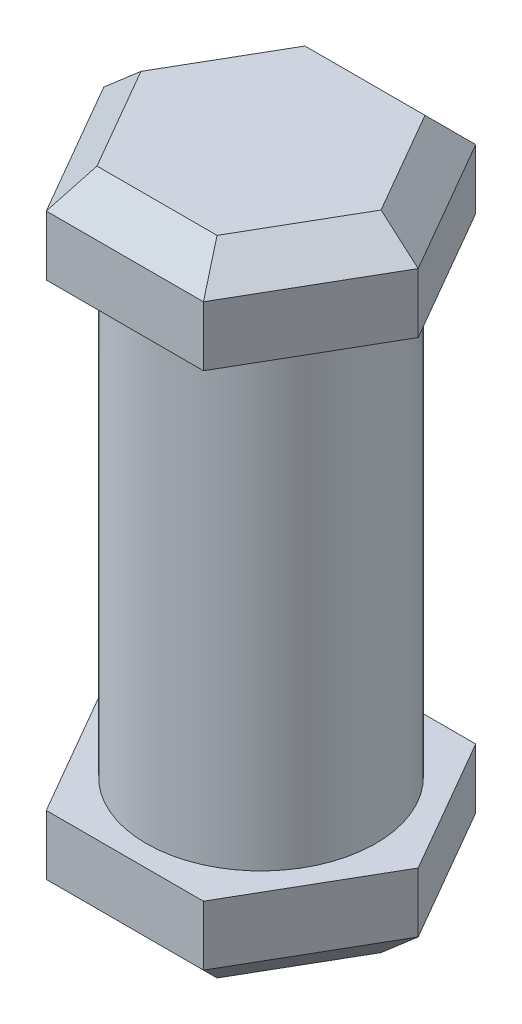
ISO-10303-21;
HEADER;
FILE_DESCRIPTION(('STEP AP214'),'2;1');
FILE_NAME('part.step','',(''),(''),'','','');
FILE_SCHEMA(('AUTOMOTIVE_DESIGN { 1 0 10303 214 1 1 1 1 }'));
ENDSEC;
DATA;
#1=APPLICATION_CONTEXT('core data for automotive mechanical design processes');
#2=APPLICATION_PROTOCOL_DEFINITION('international standard','automotive_design',2000,#1);
#3=PRODUCT_CONTEXT('',#1,'mechanical');
#4=PRODUCT('Part','Part','',(#3));
#5=PRODUCT_RELATED_PRODUCT_CATEGORY('part','',(#4));
#6=PRODUCT_DEFINITION_FORMATION('','',#4);
#7=PRODUCT_DEFINITION_CONTEXT('part definition',#1,'design');
#8=PRODUCT_DEFINITION('design','',#6,#7);
#9=PRODUCT_DEFINITION_SHAPE('','',#8);
#10=(LENGTH_UNIT() NAMED_UNIT(*) SI_UNIT(.MILLI.,.METRE.));
#11=(NAMED_UNIT(*) PLANE_ANGLE_UNIT() SI_UNIT($,.RADIAN.));
#12=(NAMED_UNIT(*) SI_UNIT($,.STERADIAN.) SOLID_ANGLE_UNIT());
#13=UNCERTAINTY_MEASURE_WITH_UNIT(LENGTH_MEASURE(1.E-05),#10,'distance_accuracy_value','');
#14=(GEOMETRIC_REPRESENTATION_CONTEXT(3) GLOBAL_UNCERTAINTY_ASSIGNED_CONTEXT((#13)) GLOBAL_UNIT_ASSIGNED_CONTEXT((#10,
#11,#12)) REPRESENTATION_CONTEXT('',''));
#15=CARTESIAN_POINT('',(0.,0.,0.));
#16=DIRECTION('',(0.,0.,1.));
#17=DIRECTION('',(1.,0.,0.));
#18=AXIS2_PLACEMENT_3D('',#15,#16,#17);
#19=CARTESIAN_POINT('',(0.,10.,0.));
#20=DIRECTION('',(0.,-1.,0.));
#21=DIRECTION('',(0.,0.,-1.));
#22=AXIS2_PLACEMENT_3D('',#19,#20,#21);
#23=CYLINDRICAL_SURFACE('',#22,2.5);
#24=CARTESIAN_POINT('',(0.,10.,0.));
#25=DIRECTION('',(0.,1.,0.));
#26=DIRECTION('',(0.,0.,1.));
#27=AXIS2_PLACEMENT_3D('',#24,#25,#26);
#28=CIRCLE('',#27,2.5);
#29=CARTESIAN_POINT('',(0.,10.,2.5));
#30=VERTEX_POINT('',#29);
#31=EDGE_CURVE('E269',#30,#30,#28,.T.);
#32=ORIENTED_EDGE('',*,*,#31,.F.);
#33=EDGE_LOOP('',(#32));
#34=FACE_BOUND('',#33,.T.);
#35=CARTESIAN_POINT('',(0.,0.,0.));
#36=DIRECTION('',(0.,1.,0.));
#37=DIRECTION('',(0.,0.,1.));
#38=AXIS2_PLACEMENT_3D('',#35,#36,#37);
#39=CIRCLE('',#38,2.5);
#40=CARTESIAN_POINT('',(0.,0.,2.5));
#41=VERTEX_POINT('',#40);
#42=EDGE_CURVE('E268',#41,#41,#39,.T.);
#43=ORIENTED_EDGE('',*,*,#42,.T.);
#44=EDGE_LOOP('',(#43));
#45=FACE_BOUND('',#44,.T.);
#46=ADVANCED_FACE('F41',(#34,#45),#23,.T.);
#47=CARTESIAN_POINT('',(1.71094385446384,-2.,-2.96344168482902));
#48=DIRECTION('',(-0.866025403784442,0.,0.499999999999995));
#49=DIRECTION('',(0.499999999999995,0.,0.866025403784442));
#50=AXIS2_PLACEMENT_3D('',#47,#48,#49);
#51=PLANE('',#50);
#52=DIRECTION('',(0.,1.,0.));
#53=VECTOR('',#52,1.);
#54=CARTESIAN_POINT('',(3.42188770892761,-2.,0.));
#55=LINE('',#54,#53);
#56=CARTESIAN_POINT('',(3.42188770892761,-1.3,0.));
#57=VERTEX_POINT('',#56);
#58=CARTESIAN_POINT('',(3.42188770892761,0.,0.));
#59=VERTEX_POINT('',#58);
#60=EDGE_CURVE('E265',#57,#59,#55,.T.);
#61=ORIENTED_EDGE('',*,*,#60,.F.);
#62=DIRECTION('',(-0.499999999999995,0.,-0.866025403784442));
#63=VECTOR('',#62,1.);
#64=CARTESIAN_POINT('',(1.71094385446384,-1.3,-2.96344168482902));
#65=LINE('',#64,#63);
#66=CARTESIAN_POINT('',(1.71094385446384,-1.3,-2.96344168482902));
#67=VERTEX_POINT('',#66);
#68=EDGE_CURVE('E311',#57,#67,#65,.T.);
#69=ORIENTED_EDGE('',*,*,#68,.T.);
#70=DIRECTION('',(0.,1.,0.));
#71=VECTOR('',#70,1.);
#72=CARTESIAN_POINT('',(1.71094385446384,-2.,-2.96344168482902));
#73=LINE('',#72,#71);
#74=CARTESIAN_POINT('',(1.71094385446384,0.,-2.96344168482902));
#75=VERTEX_POINT('',#74);
#76=EDGE_CURVE('E250',#67,#75,#73,.T.);
#77=ORIENTED_EDGE('',*,*,#76,.T.);
#78=DIRECTION('',(0.499999999999995,0.,0.866025403784441));
#79=VECTOR('',#78,1.);
#80=CARTESIAN_POINT('',(1.71094385446384,0.,-2.96344168482902));
#81=LINE('',#80,#79);
#82=EDGE_CURVE('E176',#75,#59,#81,.T.);
#83=ORIENTED_EDGE('',*,*,#82,.T.);
#84=EDGE_LOOP('',(#61,#69,#77,#83));
#85=FACE_BOUND('',#84,.T.);
#86=ADVANCED_FACE('F427',(#85),#51,.F.);
#87=CARTESIAN_POINT('',(3.42188770892761,-2.,0.));
#88=DIRECTION('',(-0.866025403784438,0.,-0.500000000000001));
#89=DIRECTION('',(-0.500000000000001,0.,0.866025403784438));
#90=AXIS2_PLACEMENT_3D('',#87,#88,#89);
#91=PLANE('',#90);
#92=DIRECTION('',(0.,1.,0.));
#93=VECTOR('',#92,1.);
#94=CARTESIAN_POINT('',(1.7109438544638,-2.,2.96344168482905));
#95=LINE('',#94,#93);
#96=CARTESIAN_POINT('',(1.7109438544638,-1.3,2.96344168482905));
#97=VERTEX_POINT('',#96);
#98=CARTESIAN_POINT('',(1.7109438544638,0.,2.96344168482905));
#99=VERTEX_POINT('',#98);
#100=EDGE_CURVE('E262',#97,#99,#95,.T.);
#101=ORIENTED_EDGE('',*,*,#100,.F.);
#102=DIRECTION('',(0.500000000000001,0.,-0.866025403784438));
#103=VECTOR('',#102,1.);
#104=CARTESIAN_POINT('',(3.42188770892761,-1.3,0.));
#105=LINE('',#104,#103);
#106=EDGE_CURVE('E308',#97,#57,#105,.T.);
#107=ORIENTED_EDGE('',*,*,#106,.T.);
#108=ORIENTED_EDGE('',*,*,#60,.T.);
#109=DIRECTION('',(-0.500000000000001,0.,0.866025403784438));
#110=VECTOR('',#109,1.);
#111=CARTESIAN_POINT('',(3.42188770892761,0.,0.));
#112=LINE('',#111,#110);
#113=EDGE_CURVE('E230',#59,#99,#112,.T.);
#114=ORIENTED_EDGE('',*,*,#113,.T.);
#115=EDGE_LOOP('',(#101,#107,#108,#114));
#116=FACE_BOUND('',#115,.T.);
#117=ADVANCED_FACE('F433',(#116),#91,.F.);
#118=CARTESIAN_POINT('',(1.7109438544638,-2.,2.96344168482905));
#119=DIRECTION('',(0.,0.,-1.));
#120=DIRECTION('',(-1.,0.,0.));
#121=AXIS2_PLACEMENT_3D('',#118,#119,#120);
#122=PLANE('',#121);
#123=DIRECTION('',(0.,1.,0.));
#124=VECTOR('',#123,1.);
#125=CARTESIAN_POINT('',(-1.71094385446382,-2.,2.96344168482903));
#126=LINE('',#125,#124);
#127=CARTESIAN_POINT('',(-1.71094385446382,-1.3,2.96344168482903));
#128=VERTEX_POINT('',#127);
#129=CARTESIAN_POINT('',(-1.71094385446382,0.,2.96344168482903));
#130=VERTEX_POINT('',#129);
#131=EDGE_CURVE('E259',#128,#130,#126,.T.);
#132=ORIENTED_EDGE('',*,*,#131,.F.);
#133=DIRECTION('',(1.,0.,0.));
#134=VECTOR('',#133,1.);
#135=CARTESIAN_POINT('',(1.7109438544638,-1.3,2.96344168482905));
#136=LINE('',#135,#134);
#137=EDGE_CURVE('E305',#128,#97,#136,.T.);
#138=ORIENTED_EDGE('',*,*,#137,.T.);
#139=ORIENTED_EDGE('',*,*,#100,.T.);
#140=DIRECTION('',(-1.,0.,0.));
#141=VECTOR('',#140,1.);
#142=CARTESIAN_POINT('',(1.7109438544638,0.,2.96344168482905));
#143=LINE('',#142,#141);
#144=EDGE_CURVE('E234',#99,#130,#143,.T.);
#145=ORIENTED_EDGE('',*,*,#144,.T.);
#146=EDGE_LOOP('',(#132,#138,#139,#145));
#147=FACE_BOUND('',#146,.T.);
#148=ADVANCED_FACE('F628',(#147),#122,.F.);
#149=CARTESIAN_POINT('',(-1.71094385446382,-2.,2.96344168482903));
#150=DIRECTION('',(0.866025403784442,0.,-0.499999999999995));
#151=DIRECTION('',(-0.499999999999995,0.,-0.866025403784442));
#152=AXIS2_PLACEMENT_3D('',#149,#150,#151);
#153=PLANE('',#152);
#154=DIRECTION('',(0.,1.,0.));
#155=VECTOR('',#154,1.);
#156=CARTESIAN_POINT('',(-3.42188770892761,-2.,0.));
#157=LINE('',#156,#155);
#158=CARTESIAN_POINT('',(-3.42188770892761,-1.3,0.));
#159=VERTEX_POINT('',#158);
#160=CARTESIAN_POINT('',(-3.42188770892761,0.,0.));
#161=VERTEX_POINT('',#160);
#162=EDGE_CURVE('E256',#159,#161,#157,.T.);
#163=ORIENTED_EDGE('',*,*,#162,.F.);
#164=DIRECTION('',(0.499999999999995,0.,0.866025403784442));
#165=VECTOR('',#164,1.);
#166=CARTESIAN_POINT('',(-1.71094385446382,-1.3,2.96344168482903));
#167=LINE('',#166,#165);
#168=EDGE_CURVE('E302',#159,#128,#167,.T.);
#169=ORIENTED_EDGE('',*,*,#168,.T.);
#170=ORIENTED_EDGE('',*,*,#131,.T.);
#171=DIRECTION('',(-0.499999999999995,0.,-0.866025403784442));
#172=VECTOR('',#171,1.);
#173=CARTESIAN_POINT('',(-1.71094385446382,0.,2.96344168482903));
#174=LINE('',#173,#172);
#175=EDGE_CURVE('E238',#130,#161,#174,.T.);
#176=ORIENTED_EDGE('',*,*,#175,.T.);
#177=EDGE_LOOP('',(#163,#169,#170,#176));
#178=FACE_BOUND('',#177,.T.);
#179=ADVANCED_FACE('F618',(#178),#153,.F.);
#180=CARTESIAN_POINT('',(-3.42188770892761,-2.,0.));
#181=DIRECTION('',(0.866025403784435,0.,0.500000000000007));
#182=DIRECTION('',(0.500000000000007,0.,-0.866025403784434));
#183=AXIS2_PLACEMENT_3D('',#180,#181,#182);
#184=PLANE('',#183);
#185=DIRECTION('',(0.,1.,0.));
#186=VECTOR('',#185,1.);
#187=CARTESIAN_POINT('',(-1.71094385446378,-2.,-2.96344168482906));
#188=LINE('',#187,#186);
#189=CARTESIAN_POINT('',(-1.71094385446378,-1.3,-2.96344168482906));
#190=VERTEX_POINT('',#189);
#191=CARTESIAN_POINT('',(-1.71094385446378,0.,-2.96344168482906));
#192=VERTEX_POINT('',#191);
#193=EDGE_CURVE('E253',#190,#192,#188,.T.);
#194=ORIENTED_EDGE('',*,*,#193,.F.);
#195=DIRECTION('',(-0.500000000000007,0.,0.866025403784434));
#196=VECTOR('',#195,1.);
#197=CARTESIAN_POINT('',(-3.42188770892761,-1.3,0.));
#198=LINE('',#197,#196);
#199=EDGE_CURVE('E299',#190,#159,#198,.T.);
#200=ORIENTED_EDGE('',*,*,#199,.T.);
#201=ORIENTED_EDGE('',*,*,#162,.T.);
#202=DIRECTION('',(0.500000000000007,0.,-0.866025403784435));
#203=VECTOR('',#202,1.);
#204=CARTESIAN_POINT('',(-3.42188770892761,0.,0.));
#205=LINE('',#204,#203);
#206=EDGE_CURVE('E242',#161,#192,#205,.T.);
#207=ORIENTED_EDGE('',*,*,#206,.T.);
#208=EDGE_LOOP('',(#194,#200,#201,#207));
#209=FACE_BOUND('',#208,.T.);
#210=ADVANCED_FACE('F608',(#209),#184,.F.);
#211=CARTESIAN_POINT('',(-1.71094385446378,-2.,-2.96344168482906));
#212=DIRECTION('',(0.,0.,1.));
#213=DIRECTION('',(1.,0.,0.));
#214=AXIS2_PLACEMENT_3D('',#211,#212,#213);
#215=PLANE('',#214);
#216=ORIENTED_EDGE('',*,*,#76,.F.);
#217=DIRECTION('',(-1.,0.,0.));
#218=VECTOR('',#217,1.);
#219=CARTESIAN_POINT('',(-1.71094385446378,-1.3,-2.96344168482906));
#220=LINE('',#219,#218);
#221=EDGE_CURVE('E295',#67,#190,#220,.T.);
#222=ORIENTED_EDGE('',*,*,#221,.T.);
#223=ORIENTED_EDGE('',*,*,#193,.T.);
#224=DIRECTION('',(1.,0.,0.));
#225=VECTOR('',#224,1.);
#226=CARTESIAN_POINT('',(-1.71094385446378,0.,-2.96344168482906));
#227=LINE('',#226,#225);
#228=EDGE_CURVE('E246',#192,#75,#227,.T.);
#229=ORIENTED_EDGE('',*,*,#228,.T.);
#230=EDGE_LOOP('',(#216,#222,#223,#229));
#231=FACE_BOUND('',#230,.T.);
#232=ADVANCED_FACE('F598',(#231),#215,.F.);
#233=CARTESIAN_POINT('',(0.,-2.,0.));
#234=DIRECTION('',(0.,-1.,0.));
#235=DIRECTION('',(0.,0.,-1.));
#236=AXIS2_PLACEMENT_3D('',#233,#234,#235);
#237=PLANE('',#236);
#238=DIRECTION('',(0.500000000000007,0.,-0.866025403784435));
#239=VECTOR('',#238,1.);
#240=CARTESIAN_POINT('',(-1.10472607181468,-2.,-2.61344168482905));
#241=LINE('',#240,#239);
#242=CARTESIAN_POINT('',(-2.61359733206214,-2.,0.));
#243=VERTEX_POINT('',#242);
#244=CARTESIAN_POINT('',(-1.30679866603105,-2.,-2.26344168482906));
#245=VERTEX_POINT('',#244);
#246=EDGE_CURVE('E288',#243,#245,#241,.T.);
#247=ORIENTED_EDGE('',*,*,#246,.T.);
#248=DIRECTION('',(1.,0.,0.));
#249=VECTOR('',#248,1.);
#250=CARTESIAN_POINT('',(1.71094385446383,-2.,-2.26344168482902));
#251=LINE('',#250,#249);
#252=CARTESIAN_POINT('',(1.3067986660311,-2.,-2.26344168482903));
#253=VERTEX_POINT('',#252);
#254=EDGE_CURVE('E291',#245,#253,#251,.T.);
#255=ORIENTED_EDGE('',*,*,#254,.T.);
#256=DIRECTION('',(0.499999999999995,0.,0.866025403784442));
#257=VECTOR('',#256,1.);
#258=CARTESIAN_POINT('',(2.8156699262785,-2.,0.349999999999995));
#259=LINE('',#258,#257);
#260=CARTESIAN_POINT('',(2.61359733206214,-2.,0.));
#261=VERTEX_POINT('',#260);
#262=EDGE_CURVE('E273',#253,#261,#259,.T.);
#263=ORIENTED_EDGE('',*,*,#262,.T.);
#264=DIRECTION('',(-0.500000000000001,0.,0.866025403784438));
#265=VECTOR('',#264,1.);
#266=CARTESIAN_POINT('',(1.10472607181469,-2.,2.61344168482905));
#267=LINE('',#266,#265);
#268=CARTESIAN_POINT('',(1.30679866603106,-2.,2.26344168482905));
#269=VERTEX_POINT('',#268);
#270=EDGE_CURVE('E279',#261,#269,#267,.T.);
#271=ORIENTED_EDGE('',*,*,#270,.T.);
#272=DIRECTION('',(-1.,0.,0.));
#273=VECTOR('',#272,1.);
#274=CARTESIAN_POINT('',(-1.71094385446382,-2.,2.26344168482904));
#275=LINE('',#274,#273);
#276=CARTESIAN_POINT('',(-1.30679866603108,-2.,2.26344168482904));
#277=VERTEX_POINT('',#276);
#278=EDGE_CURVE('E282',#269,#277,#275,.T.);
#279=ORIENTED_EDGE('',*,*,#278,.T.);
#280=DIRECTION('',(-0.499999999999995,0.,-0.866025403784442));
#281=VECTOR('',#280,1.);
#282=CARTESIAN_POINT('',(-2.8156699262785,-2.,-0.350000000000019));
#283=LINE('',#282,#281);
#284=EDGE_CURVE('E285',#277,#243,#283,.T.);
#285=ORIENTED_EDGE('',*,*,#284,.T.);
#286=EDGE_LOOP('',(#247,#255,#263,#271,#279,#285));
#287=FACE_BOUND('',#286,.T.);
#288=ADVANCED_FACE('F593',(#287),#237,.T.);
#289=CARTESIAN_POINT('',(0.,0.,0.));
#290=DIRECTION('',(0.,-1.,0.));
#291=DIRECTION('',(0.,0.,-1.));
#292=AXIS2_PLACEMENT_3D('',#289,#290,#291);
#293=PLANE('',#292);
#294=ORIENTED_EDGE('',*,*,#42,.F.);
#295=EDGE_LOOP('',(#294));
#296=FACE_BOUND('',#295,.T.);
#297=ORIENTED_EDGE('',*,*,#82,.F.);
#298=ORIENTED_EDGE('',*,*,#228,.F.);
#299=ORIENTED_EDGE('',*,*,#206,.F.);
#300=ORIENTED_EDGE('',*,*,#175,.F.);
#301=ORIENTED_EDGE('',*,*,#144,.F.);
#302=ORIENTED_EDGE('',*,*,#113,.F.);
#303=EDGE_LOOP('',(#297,#298,#299,#300,#301,#302));
#304=FACE_BOUND('',#303,.T.);
#305=ADVANCED_FACE('F586',(#296,#304),#293,.F.);
#306=CARTESIAN_POINT('',(1.7109438544638,12.,-2.96344168482905));
#307=DIRECTION('',(0.,0.,1.));
#308=DIRECTION('',(1.,0.,0.));
#309=AXIS2_PLACEMENT_3D('',#306,#307,#308);
#310=PLANE('',#309);
#311=DIRECTION('',(0.,-1.,0.));
#312=VECTOR('',#311,1.);
#313=CARTESIAN_POINT('',(-1.71094385446382,12.,-2.96344168482903));
#314=LINE('',#313,#312);
#315=CARTESIAN_POINT('',(-1.71094385446382,11.3,-2.96344168482903));
#316=VERTEX_POINT('',#315);
#317=CARTESIAN_POINT('',(-1.71094385446382,10.,-2.96344168482903));
#318=VERTEX_POINT('',#317);
#319=EDGE_CURVE('E167',#316,#318,#314,.T.);
#320=ORIENTED_EDGE('',*,*,#319,.F.);
#321=DIRECTION('',(1.,0.,0.));
#322=VECTOR('',#321,1.);
#323=CARTESIAN_POINT('',(1.7109438544638,11.3,-2.96344168482905));
#324=LINE('',#323,#322);
#325=CARTESIAN_POINT('',(1.7109438544638,11.3,-2.96344168482905));
#326=VERTEX_POINT('',#325);
#327=EDGE_CURVE('E11',#316,#326,#324,.T.);
#328=ORIENTED_EDGE('',*,*,#327,.T.);
#329=DIRECTION('',(0.,-1.,0.));
#330=VECTOR('',#329,1.);
#331=CARTESIAN_POINT('',(1.7109438544638,12.,-2.96344168482905));
#332=LINE('',#331,#330);
#333=CARTESIAN_POINT('',(1.7109438544638,10.,-2.96344168482905));
#334=VERTEX_POINT('',#333);
#335=EDGE_CURVE('E191',#326,#334,#332,.T.);
#336=ORIENTED_EDGE('',*,*,#335,.T.);
#337=DIRECTION('',(-1.,0.,0.));
#338=VECTOR('',#337,1.);
#339=CARTESIAN_POINT('',(1.7109438544638,10.,-2.96344168482905));
#340=LINE('',#339,#338);
#341=EDGE_CURVE('E183',#334,#318,#340,.T.);
#342=ORIENTED_EDGE('',*,*,#341,.T.);
#343=EDGE_LOOP('',(#320,#328,#336,#342));
#344=FACE_BOUND('',#343,.T.);
#345=ADVANCED_FACE('F189',(#344),#310,.F.);
#346=CARTESIAN_POINT('',(-1.71094385446382,12.,-2.96344168482903));
#347=DIRECTION('',(0.866025403784442,0.,0.499999999999995));
#348=DIRECTION('',(0.499999999999995,0.,-0.866025403784442));
#349=AXIS2_PLACEMENT_3D('',#346,#347,#348);
#350=PLANE('',#349);
#351=DIRECTION('',(0.,-1.,0.));
#352=VECTOR('',#351,1.);
#353=CARTESIAN_POINT('',(-3.42188770892761,12.,0.));
#354=LINE('',#353,#352);
#355=CARTESIAN_POINT('',(-3.42188770892761,11.3,0.));
#356=VERTEX_POINT('',#355);
#357=CARTESIAN_POINT('',(-3.42188770892761,10.,0.));
#358=VERTEX_POINT('',#357);
#359=EDGE_CURVE('E177',#356,#358,#354,.T.);
#360=ORIENTED_EDGE('',*,*,#359,.F.);
#361=DIRECTION('',(0.499999999999995,0.,-0.866025403784442));
#362=VECTOR('',#361,1.);
#363=CARTESIAN_POINT('',(-1.71094385446382,11.3,-2.96344168482903));
#364=LINE('',#363,#362);
#365=EDGE_CURVE('E52',#356,#316,#364,.T.);
#366=ORIENTED_EDGE('',*,*,#365,.T.);
#367=ORIENTED_EDGE('',*,*,#319,.T.);
#368=DIRECTION('',(-0.499999999999995,0.,0.866025403784442));
#369=VECTOR('',#368,1.);
#370=CARTESIAN_POINT('',(-1.71094385446382,10.,-2.96344168482903));
#371=LINE('',#370,#369);
#372=EDGE_CURVE('E170',#318,#358,#371,.T.);
#373=ORIENTED_EDGE('',*,*,#372,.T.);
#374=EDGE_LOOP('',(#360,#366,#367,#373));
#375=FACE_BOUND('',#374,.T.);
#376=ADVANCED_FACE('F169',(#375),#350,.F.);
#377=CARTESIAN_POINT('',(-3.42188770892761,12.,0.));
#378=DIRECTION('',(0.866025403784435,0.,-0.500000000000007));
#379=DIRECTION('',(-0.500000000000007,0.,-0.866025403784434));
#380=AXIS2_PLACEMENT_3D('',#377,#378,#379);
#381=PLANE('',#380);
#382=DIRECTION('',(0.,-1.,0.));
#383=VECTOR('',#382,1.);
#384=CARTESIAN_POINT('',(-1.71094385446378,12.,2.96344168482906));
#385=LINE('',#384,#383);
#386=CARTESIAN_POINT('',(-1.71094385446378,11.3,2.96344168482906));
#387=VERTEX_POINT('',#386);
#388=CARTESIAN_POINT('',(-1.71094385446378,10.,2.96344168482906));
#389=VERTEX_POINT('',#388);
#390=EDGE_CURVE('E222',#387,#389,#385,.T.);
#391=ORIENTED_EDGE('',*,*,#390,.F.);
#392=DIRECTION('',(-0.500000000000007,0.,-0.866025403784434));
#393=VECTOR('',#392,1.);
#394=CARTESIAN_POINT('',(-3.42188770892761,11.3,0.));
#395=LINE('',#394,#393);
#396=EDGE_CURVE('E67',#387,#356,#395,.T.);
#397=ORIENTED_EDGE('',*,*,#396,.T.);
#398=ORIENTED_EDGE('',*,*,#359,.T.);
#399=DIRECTION('',(0.500000000000007,0.,0.866025403784435));
#400=VECTOR('',#399,1.);
#401=CARTESIAN_POINT('',(-3.42188770892761,10.,0.));
#402=LINE('',#401,#400);
#403=EDGE_CURVE('E186',#358,#389,#402,.T.);
#404=ORIENTED_EDGE('',*,*,#403,.T.);
#405=EDGE_LOOP('',(#391,#397,#398,#404));
#406=FACE_BOUND('',#405,.T.);
#407=ADVANCED_FACE('F417',(#406),#381,.F.);
#408=CARTESIAN_POINT('',(-1.71094385446378,12.,2.96344168482906));
#409=DIRECTION('',(0.,0.,-1.));
#410=DIRECTION('',(-1.,0.,0.));
#411=AXIS2_PLACEMENT_3D('',#408,#409,#410);
#412=PLANE('',#411);
#413=DIRECTION('',(0.,-1.,0.));
#414=VECTOR('',#413,1.);
#415=CARTESIAN_POINT('',(1.71094385446384,12.,2.96344168482902));
#416=LINE('',#415,#414);
#417=CARTESIAN_POINT('',(1.71094385446384,11.3,2.96344168482902));
#418=VERTEX_POINT('',#417);
#419=CARTESIAN_POINT('',(1.71094385446384,10.,2.96344168482902));
#420=VERTEX_POINT('',#419);
#421=EDGE_CURVE('E219',#418,#420,#416,.T.);
#422=ORIENTED_EDGE('',*,*,#421,.F.);
#423=DIRECTION('',(-1.,0.,0.));
#424=VECTOR('',#423,1.);
#425=CARTESIAN_POINT('',(-1.71094385446378,11.3,2.96344168482906));
#426=LINE('',#425,#424);
#427=EDGE_CURVE('E340',#418,#387,#426,.T.);
#428=ORIENTED_EDGE('',*,*,#427,.T.);
#429=ORIENTED_EDGE('',*,*,#390,.T.);
#430=DIRECTION('',(1.,0.,0.));
#431=VECTOR('',#430,1.);
#432=CARTESIAN_POINT('',(-1.71094385446378,10.,2.96344168482906));
#433=LINE('',#432,#431);
#434=EDGE_CURVE('E203',#389,#420,#433,.T.);
#435=ORIENTED_EDGE('',*,*,#434,.T.);
#436=EDGE_LOOP('',(#422,#428,#429,#435));
#437=FACE_BOUND('',#436,.T.);
#438=ADVANCED_FACE('F415',(#437),#412,.F.);
#439=CARTESIAN_POINT('',(1.71094385446384,12.,2.96344168482902));
#440=DIRECTION('',(-0.866025403784442,0.,-0.499999999999995));
#441=DIRECTION('',(-0.499999999999995,0.,0.866025403784442));
#442=AXIS2_PLACEMENT_3D('',#439,#440,#441);
#443=PLANE('',#442);
#444=DIRECTION('',(0.,-1.,0.));
#445=VECTOR('',#444,1.);
#446=CARTESIAN_POINT('',(3.42188770892761,12.,0.));
#447=LINE('',#446,#445);
#448=CARTESIAN_POINT('',(3.42188770892761,11.3,0.));
#449=VERTEX_POINT('',#448);
#450=CARTESIAN_POINT('',(3.42188770892761,10.,0.));
#451=VERTEX_POINT('',#450);
#452=EDGE_CURVE('E216',#449,#451,#447,.T.);
#453=ORIENTED_EDGE('',*,*,#452,.F.);
#454=DIRECTION('',(-0.499999999999995,0.,0.866025403784442));
#455=VECTOR('',#454,1.);
#456=CARTESIAN_POINT('',(1.71094385446384,11.3,2.96344168482902));
#457=LINE('',#456,#455);
#458=EDGE_CURVE('E337',#449,#418,#457,.T.);
#459=ORIENTED_EDGE('',*,*,#458,.T.);
#460=ORIENTED_EDGE('',*,*,#421,.T.);
#461=DIRECTION('',(0.499999999999995,0.,-0.866025403784441));
#462=VECTOR('',#461,1.);
#463=CARTESIAN_POINT('',(1.71094385446384,10.,2.96344168482902));
#464=LINE('',#463,#462);
#465=EDGE_CURVE('E207',#420,#451,#464,.T.);
#466=ORIENTED_EDGE('',*,*,#465,.T.);
#467=EDGE_LOOP('',(#453,#459,#460,#466));
#468=FACE_BOUND('',#467,.T.);
#469=ADVANCED_FACE('F413',(#468),#443,.F.);
#470=CARTESIAN_POINT('',(3.42188770892761,12.,0.));
#471=DIRECTION('',(-0.866025403784438,0.,0.500000000000001));
#472=DIRECTION('',(0.500000000000001,0.,0.866025403784438));
#473=AXIS2_PLACEMENT_3D('',#470,#471,#472);
#474=PLANE('',#473);
#475=ORIENTED_EDGE('',*,*,#335,.F.);
#476=DIRECTION('',(0.500000000000001,0.,0.866025403784438));
#477=VECTOR('',#476,1.);
#478=CARTESIAN_POINT('',(3.42188770892761,11.3,0.));
#479=LINE('',#478,#477);
#480=EDGE_CURVE('E333',#326,#449,#479,.T.);
#481=ORIENTED_EDGE('',*,*,#480,.T.);
#482=ORIENTED_EDGE('',*,*,#452,.T.);
#483=DIRECTION('',(-0.500000000000001,0.,-0.866025403784438));
#484=VECTOR('',#483,1.);
#485=CARTESIAN_POINT('',(3.42188770892761,10.,0.));
#486=LINE('',#485,#484);
#487=EDGE_CURVE('E211',#451,#334,#486,.T.);
#488=ORIENTED_EDGE('',*,*,#487,.T.);
#489=EDGE_LOOP('',(#475,#481,#482,#488));
#490=FACE_BOUND('',#489,.T.);
#491=ADVANCED_FACE('F401',(#490),#474,.F.);
#492=CARTESIAN_POINT('',(0.,12.,0.));
#493=DIRECTION('',(0.,1.,0.));
#494=DIRECTION('',(0.,0.,1.));
#495=AXIS2_PLACEMENT_3D('',#492,#493,#494);
#496=PLANE('',#495);
#497=DIRECTION('',(0.499999999999995,0.,-0.866025403784442));
#498=VECTOR('',#497,1.);
#499=CARTESIAN_POINT('',(2.8156699262785,12.,-0.349999999999995));
#500=LINE('',#499,#498);
#501=CARTESIAN_POINT('',(1.3067986660311,12.,2.26344168482903));
#502=VERTEX_POINT('',#501);
#503=CARTESIAN_POINT('',(2.61359733206214,12.,0.));
#504=VERTEX_POINT('',#503);
#505=EDGE_CURVE('E326',#502,#504,#500,.T.);
#506=ORIENTED_EDGE('',*,*,#505,.T.);
#507=DIRECTION('',(-0.500000000000001,0.,-0.866025403784438));
#508=VECTOR('',#507,1.);
#509=CARTESIAN_POINT('',(1.10472607181469,12.,-2.61344168482905));
#510=LINE('',#509,#508);
#511=CARTESIAN_POINT('',(1.30679866603106,12.,-2.26344168482905));
#512=VERTEX_POINT('',#511);
#513=EDGE_CURVE('E329',#504,#512,#510,.T.);
#514=ORIENTED_EDGE('',*,*,#513,.T.);
#515=DIRECTION('',(-1.,0.,0.));
#516=VECTOR('',#515,1.);
#517=CARTESIAN_POINT('',(-1.71094385446382,12.,-2.26344168482904));
#518=LINE('',#517,#516);
#519=CARTESIAN_POINT('',(-1.30679866603108,12.,-2.26344168482904));
#520=VERTEX_POINT('',#519);
#521=EDGE_CURVE('E314',#512,#520,#518,.T.);
#522=ORIENTED_EDGE('',*,*,#521,.T.);
#523=DIRECTION('',(-0.499999999999995,0.,0.866025403784442));
#524=VECTOR('',#523,1.);
#525=CARTESIAN_POINT('',(-2.8156699262785,12.,0.350000000000019));
#526=LINE('',#525,#524);
#527=CARTESIAN_POINT('',(-2.61359733206214,12.,0.));
#528=VERTEX_POINT('',#527);
#529=EDGE_CURVE('E317',#520,#528,#526,.T.);
#530=ORIENTED_EDGE('',*,*,#529,.T.);
#531=DIRECTION('',(0.500000000000007,0.,0.866025403784435));
#532=VECTOR('',#531,1.);
#533=CARTESIAN_POINT('',(-1.10472607181467,12.,2.61344168482905));
#534=LINE('',#533,#532);
#535=CARTESIAN_POINT('',(-1.30679866603105,12.,2.26344168482906));
#536=VERTEX_POINT('',#535);
#537=EDGE_CURVE('E320',#528,#536,#534,.T.);
#538=ORIENTED_EDGE('',*,*,#537,.T.);
#539=DIRECTION('',(1.,0.,0.));
#540=VECTOR('',#539,1.);
#541=CARTESIAN_POINT('',(1.71094385446383,12.,2.26344168482902));
#542=LINE('',#541,#540);
#543=EDGE_CURVE('E323',#536,#502,#542,.T.);
#544=ORIENTED_EDGE('',*,*,#543,.T.);
#545=EDGE_LOOP('',(#506,#514,#522,#530,#538,#544));
#546=FACE_BOUND('',#545,.T.);
#547=ADVANCED_FACE('F541',(#546),#496,.T.);
#548=CARTESIAN_POINT('',(0.,10.,0.));
#549=DIRECTION('',(0.,1.,0.));
#550=DIRECTION('',(0.,0.,1.));
#551=AXIS2_PLACEMENT_3D('',#548,#549,#550);
#552=PLANE('',#551);
#553=ORIENTED_EDGE('',*,*,#31,.T.);
#554=EDGE_LOOP('',(#553));
#555=FACE_BOUND('',#554,.T.);
#556=ORIENTED_EDGE('',*,*,#341,.F.);
#557=ORIENTED_EDGE('',*,*,#487,.F.);
#558=ORIENTED_EDGE('',*,*,#465,.F.);
#559=ORIENTED_EDGE('',*,*,#434,.F.);
#560=ORIENTED_EDGE('',*,*,#403,.F.);
#561=ORIENTED_EDGE('',*,*,#372,.F.);
#562=EDGE_LOOP('',(#556,#557,#558,#559,#560,#561));
#563=FACE_BOUND('',#562,.T.);
#564=ADVANCED_FACE('F181',(#555,#563),#552,.F.);
#565=CARTESIAN_POINT('',(0.,-2.,2.26344168482904));
#566=DIRECTION('',(0.,-0.707106781186545,0.70710678118655));
#567=DIRECTION('',(1.,0.,0.));
#568=AXIS2_PLACEMENT_3D('',#565,#566,#567);
#569=PLANE('',#568);
#570=DIRECTION('',(-0.377964473009224,-0.654653670707979,-0.654653670707977));
#571=VECTOR('',#570,1.);
#572=CARTESIAN_POINT('',(1.12011314231234,-2.32334881211844,1.94009287271061));
#573=LINE('',#572,#571);
#574=EDGE_CURVE('E198',#97,#269,#573,.T.);
#575=ORIENTED_EDGE('',*,*,#574,.F.);
#576=ORIENTED_EDGE('',*,*,#137,.F.);
#577=DIRECTION('',(0.37796447300923,-0.654653670707979,-0.654653670707974));
#578=VECTOR('',#577,1.);
#579=CARTESIAN_POINT('',(-1.12011314231235,-2.32334881211844,1.9400928727106));
#580=LINE('',#579,#578);
#581=EDGE_CURVE('E194',#277,#128,#580,.F.);
#582=ORIENTED_EDGE('',*,*,#581,.F.);
#583=ORIENTED_EDGE('',*,*,#278,.F.);
#584=EDGE_LOOP('',(#575,#576,#582,#583));
#585=FACE_BOUND('',#584,.T.);
#586=ADVANCED_FACE('F475',(#585),#569,.T.);
#587=CARTESIAN_POINT('',(-1.96019799904661,-2.,1.13172084241451));
#588=DIRECTION('',(-0.612372435695798,-0.707106781186546,0.353553390593271));
#589=DIRECTION('',(0.499999999999995,0.,0.866025403784442));
#590=AXIS2_PLACEMENT_3D('',#587,#588,#589);
#591=PLANE('',#590);
#592=ORIENTED_EDGE('',*,*,#581,.T.);
#593=ORIENTED_EDGE('',*,*,#168,.F.);
#594=DIRECTION('',(0.755928946018453,-0.654653670707979,0.));
#595=VECTOR('',#594,1.);
#596=CARTESIAN_POINT('',(-2.24022628462469,-2.32334881211844,0.));
#597=LINE('',#596,#595);
#598=EDGE_CURVE('E357',#243,#159,#597,.F.);
#599=ORIENTED_EDGE('',*,*,#598,.F.);
#600=ORIENTED_EDGE('',*,*,#284,.F.);
#601=EDGE_LOOP('',(#592,#593,#599,#600));
#602=FACE_BOUND('',#601,.T.);
#603=ADVANCED_FACE('F468',(#602),#591,.T.);
#604=CARTESIAN_POINT('',(1.9601979990466,-2.,1.13172084241452));
#605=DIRECTION('',(0.612372435695796,-0.707106781186545,0.353553390593276));
#606=DIRECTION('',(0.500000000000001,0.,-0.866025403784438));
#607=AXIS2_PLACEMENT_3D('',#604,#605,#606);
#608=PLANE('',#607);
#609=ORIENTED_EDGE('',*,*,#574,.T.);
#610=ORIENTED_EDGE('',*,*,#270,.F.);
#611=DIRECTION('',(-0.755928946018452,-0.65465367070798,0.));
#612=VECTOR('',#611,1.);
#613=CARTESIAN_POINT('',(2.2402262846247,-2.32334881211843,0.));
#614=LINE('',#613,#612);
#615=EDGE_CURVE('E353',#57,#261,#614,.T.);
#616=ORIENTED_EDGE('',*,*,#615,.F.);
#617=ORIENTED_EDGE('',*,*,#106,.F.);
#618=EDGE_LOOP('',(#609,#610,#616,#617));
#619=FACE_BOUND('',#618,.T.);
#620=ADVANCED_FACE('F461',(#619),#608,.T.);
#621=CARTESIAN_POINT('',(-1.96019799904659,-2.,-1.13172084241454));
#622=DIRECTION('',(-0.612372435695793,-0.707106781186546,-0.35355339059328));
#623=DIRECTION('',(-0.500000000000007,0.,0.866025403784434));
#624=AXIS2_PLACEMENT_3D('',#621,#622,#623);
#625=PLANE('',#624);
#626=ORIENTED_EDGE('',*,*,#598,.T.);
#627=ORIENTED_EDGE('',*,*,#199,.F.);
#628=DIRECTION('',(0.377964473009221,-0.654653670707979,0.654653670707979));
#629=VECTOR('',#628,1.);
#630=CARTESIAN_POINT('',(-1.12011314231233,-2.32334881211844,-1.94009287271062));
#631=LINE('',#630,#629);
#632=EDGE_CURVE('E350',#245,#190,#631,.F.);
#633=ORIENTED_EDGE('',*,*,#632,.F.);
#634=ORIENTED_EDGE('',*,*,#246,.F.);
#635=EDGE_LOOP('',(#626,#627,#633,#634));
#636=FACE_BOUND('',#635,.T.);
#637=ADVANCED_FACE('F454',(#636),#625,.T.);
#638=CARTESIAN_POINT('',(1.96019799904662,-2.,-1.13172084241452));
#639=DIRECTION('',(0.612372435695798,-0.707106781186545,-0.353553390593271));
#640=DIRECTION('',(-0.499999999999995,0.,-0.866025403784442));
#641=AXIS2_PLACEMENT_3D('',#638,#639,#640);
#642=PLANE('',#641);
#643=ORIENTED_EDGE('',*,*,#615,.T.);
#644=ORIENTED_EDGE('',*,*,#262,.F.);
#645=DIRECTION('',(0.377964473009231,0.65465367070798,-0.654653670707972));
#646=VECTOR('',#645,1.);
#647=CARTESIAN_POINT('',(1.12011314231238,-2.32334881211843,-1.9400928727106));
#648=LINE('',#647,#646);
#649=EDGE_CURVE('E347',#67,#253,#648,.F.);
#650=ORIENTED_EDGE('',*,*,#649,.F.);
#651=ORIENTED_EDGE('',*,*,#68,.F.);
#652=EDGE_LOOP('',(#643,#644,#650,#651));
#653=FACE_BOUND('',#652,.T.);
#654=ADVANCED_FACE('F447',(#653),#642,.T.);
#655=CARTESIAN_POINT('',(0.,-2.,-2.26344168482904));
#656=DIRECTION('',(0.,-0.707106781186545,-0.70710678118655));
#657=DIRECTION('',(-1.,0.,0.));
#658=AXIS2_PLACEMENT_3D('',#655,#656,#657);
#659=PLANE('',#658);
#660=ORIENTED_EDGE('',*,*,#632,.T.);
#661=ORIENTED_EDGE('',*,*,#221,.F.);
#662=ORIENTED_EDGE('',*,*,#649,.T.);
#663=ORIENTED_EDGE('',*,*,#254,.F.);
#664=EDGE_LOOP('',(#660,#661,#662,#663));
#665=FACE_BOUND('',#664,.T.);
#666=ADVANCED_FACE('F441',(#665),#659,.T.);
#667=CARTESIAN_POINT('',(-1.96019799904659,12.,1.13172084241454));
#668=DIRECTION('',(-0.612372435695792,0.707106781186547,0.353553390593279));
#669=DIRECTION('',(-0.500000000000007,0.,-0.866025403784434));
#670=AXIS2_PLACEMENT_3D('',#667,#668,#669);
#671=PLANE('',#670);
#672=DIRECTION('',(0.755928946018454,0.654653670707978,0.));
#673=VECTOR('',#672,1.);
#674=CARTESIAN_POINT('',(-2.24022628462469,12.3233488121184,0.));
#675=LINE('',#674,#673);
#676=EDGE_CURVE('E377',#356,#528,#675,.T.);
#677=ORIENTED_EDGE('',*,*,#676,.F.);
#678=ORIENTED_EDGE('',*,*,#396,.F.);
#679=DIRECTION('',(0.377964473009221,0.654653670707978,-0.65465367070798));
#680=VECTOR('',#679,1.);
#681=CARTESIAN_POINT('',(-1.12011314231233,12.3233488121184,1.94009287271062));
#682=LINE('',#681,#680);
#683=EDGE_CURVE('E46',#536,#387,#682,.F.);
#684=ORIENTED_EDGE('',*,*,#683,.F.);
#685=ORIENTED_EDGE('',*,*,#537,.F.);
#686=EDGE_LOOP('',(#677,#678,#684,#685));
#687=FACE_BOUND('',#686,.T.);
#688=ADVANCED_FACE('F44',(#687),#671,.T.);
#689=CARTESIAN_POINT('',(0.,12.,2.26344168482904));
#690=DIRECTION('',(0.,0.707106781186547,0.707106781186548));
#691=DIRECTION('',(-1.,0.,0.));
#692=AXIS2_PLACEMENT_3D('',#689,#690,#691);
#693=PLANE('',#692);
#694=ORIENTED_EDGE('',*,*,#683,.T.);
#695=ORIENTED_EDGE('',*,*,#427,.F.);
#696=DIRECTION('',(-0.377964473009231,0.654653670707979,-0.654653670707973));
#697=VECTOR('',#696,1.);
#698=CARTESIAN_POINT('',(1.12011314231237,12.3233488121184,1.9400928727106));
#699=LINE('',#698,#697);
#700=EDGE_CURVE('E374',#502,#418,#699,.F.);
#701=ORIENTED_EDGE('',*,*,#700,.F.);
#702=ORIENTED_EDGE('',*,*,#543,.F.);
#703=EDGE_LOOP('',(#694,#695,#701,#702));
#704=FACE_BOUND('',#703,.T.);
#705=ADVANCED_FACE('F389',(#704),#693,.T.);
#706=CARTESIAN_POINT('',(-1.96019799904661,12.,-1.13172084241451));
#707=DIRECTION('',(-0.612372435695797,0.707106781186547,-0.353553390593271));
#708=DIRECTION('',(0.499999999999995,0.,-0.866025403784442));
#709=AXIS2_PLACEMENT_3D('',#706,#707,#708);
#710=PLANE('',#709);
#711=ORIENTED_EDGE('',*,*,#676,.T.);
#712=ORIENTED_EDGE('',*,*,#529,.F.);
#713=DIRECTION('',(0.37796447300923,0.654653670707978,0.654653670707975));
#714=VECTOR('',#713,1.);
#715=CARTESIAN_POINT('',(-1.12011314231235,12.3233488121184,-1.9400928727106));
#716=LINE('',#715,#714);
#717=EDGE_CURVE('E370',#316,#520,#716,.T.);
#718=ORIENTED_EDGE('',*,*,#717,.F.);
#719=ORIENTED_EDGE('',*,*,#365,.F.);
#720=EDGE_LOOP('',(#711,#712,#718,#719));
#721=FACE_BOUND('',#720,.T.);
#722=ADVANCED_FACE('F393',(#721),#710,.T.);
#723=CARTESIAN_POINT('',(1.96019799904662,12.,1.13172084241452));
#724=DIRECTION('',(0.612372435695797,0.707106781186546,0.353553390593271));
#725=DIRECTION('',(-0.499999999999995,0.,0.866025403784442));
#726=AXIS2_PLACEMENT_3D('',#723,#724,#725);
#727=PLANE('',#726);
#728=ORIENTED_EDGE('',*,*,#700,.T.);
#729=ORIENTED_EDGE('',*,*,#458,.F.);
#730=DIRECTION('',(-0.755928946018453,0.654653670707979,0.));
#731=VECTOR('',#730,1.);
#732=CARTESIAN_POINT('',(2.2402262846247,12.3233488121184,0.));
#733=LINE('',#732,#731);
#734=EDGE_CURVE('E367',#504,#449,#733,.F.);
#735=ORIENTED_EDGE('',*,*,#734,.F.);
#736=ORIENTED_EDGE('',*,*,#505,.F.);
#737=EDGE_LOOP('',(#728,#729,#735,#736));
#738=FACE_BOUND('',#737,.T.);
#739=ADVANCED_FACE('F410',(#738),#727,.T.);
#740=CARTESIAN_POINT('',(0.,12.,-2.26344168482904));
#741=DIRECTION('',(0.,0.707106781186547,-0.707106781186548));
#742=DIRECTION('',(1.,0.,0.));
#743=AXIS2_PLACEMENT_3D('',#740,#741,#742);
#744=PLANE('',#743);
#745=ORIENTED_EDGE('',*,*,#717,.T.);
#746=ORIENTED_EDGE('',*,*,#521,.F.);
#747=DIRECTION('',(0.377964473009225,-0.654653670707978,-0.654653670707978));
#748=VECTOR('',#747,1.);
#749=CARTESIAN_POINT('',(1.12011314231234,12.3233488121184,-1.94009287271061));
#750=LINE('',#749,#748);
#751=EDGE_CURVE('E364',#326,#512,#750,.F.);
#752=ORIENTED_EDGE('',*,*,#751,.F.);
#753=ORIENTED_EDGE('',*,*,#327,.F.);
#754=EDGE_LOOP('',(#745,#746,#752,#753));
#755=FACE_BOUND('',#754,.T.);
#756=ADVANCED_FACE('F398',(#755),#744,.T.);
#757=CARTESIAN_POINT('',(1.9601979990466,12.,-1.13172084241452));
#758=DIRECTION('',(0.612372435695795,0.707106781186547,-0.353553390593275));
#759=DIRECTION('',(0.500000000000001,0.,0.866025403784438));
#760=AXIS2_PLACEMENT_3D('',#757,#758,#759);
#761=PLANE('',#760);
#762=ORIENTED_EDGE('',*,*,#734,.T.);
#763=ORIENTED_EDGE('',*,*,#480,.F.);
#764=ORIENTED_EDGE('',*,*,#751,.T.);
#765=ORIENTED_EDGE('',*,*,#513,.F.);
#766=EDGE_LOOP('',(#762,#763,#764,#765));
#767=FACE_BOUND('',#766,.T.);
#768=ADVANCED_FACE('F404',(#767),#761,.T.);
#769=CLOSED_SHELL('',(#46,#86,#117,#148,#179,#210,#232,#288,#305,#345,#376,#407,#438,#469,#491,
#547,#564,#586,#603,#620,#637,#654,#666,#688,#705,#722,#739,#756,#768));
#770=MANIFOLD_SOLID_BREP('B2',#769);
#771=ADVANCED_BREP_SHAPE_REPRESENTATION('',(#18,#770),#14);
#772=SHAPE_DEFINITION_REPRESENTATION(#9,#771);
ENDSEC;
END-ISO-10303-21;
